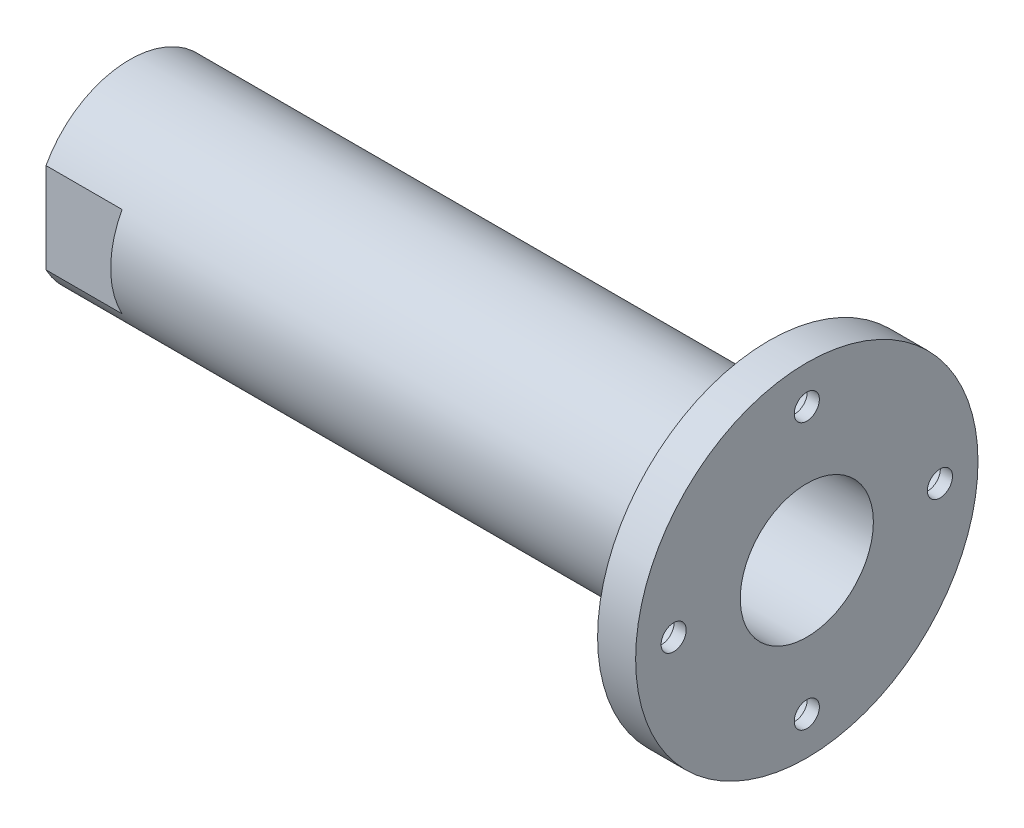
ISO-10303-21;
HEADER;
FILE_DESCRIPTION(('STEP AP214'),'2;1');
FILE_NAME('part.step','',(''),(''),'','','');
FILE_SCHEMA(('AUTOMOTIVE_DESIGN { 1 0 10303 214 1 1 1 1 }'));
ENDSEC;
DATA;
#1=APPLICATION_CONTEXT('core data for automotive mechanical design processes');
#2=APPLICATION_PROTOCOL_DEFINITION('international standard','automotive_design',2000,#1);
#3=PRODUCT_CONTEXT('',#1,'mechanical');
#4=PRODUCT('Part','Part','',(#3));
#5=PRODUCT_RELATED_PRODUCT_CATEGORY('part','',(#4));
#6=PRODUCT_DEFINITION_FORMATION('','',#4);
#7=PRODUCT_DEFINITION_CONTEXT('part definition',#1,'design');
#8=PRODUCT_DEFINITION('design','',#6,#7);
#9=PRODUCT_DEFINITION_SHAPE('','',#8);
#10=(LENGTH_UNIT() NAMED_UNIT(*) SI_UNIT(.MILLI.,.METRE.));
#11=(NAMED_UNIT(*) PLANE_ANGLE_UNIT() SI_UNIT($,.RADIAN.));
#12=(NAMED_UNIT(*) SI_UNIT($,.STERADIAN.) SOLID_ANGLE_UNIT());
#13=UNCERTAINTY_MEASURE_WITH_UNIT(LENGTH_MEASURE(1.E-05),#10,'distance_accuracy_value','');
#14=(GEOMETRIC_REPRESENTATION_CONTEXT(3) GLOBAL_UNCERTAINTY_ASSIGNED_CONTEXT((#13)) GLOBAL_UNIT_ASSIGNED_CONTEXT((#10,
#11,#12)) REPRESENTATION_CONTEXT('',''));
#15=CARTESIAN_POINT('',(0.,0.,0.));
#16=DIRECTION('',(0.,0.,1.));
#17=DIRECTION('',(1.,0.,0.));
#18=AXIS2_PLACEMENT_3D('',#15,#16,#17);
#19=CARTESIAN_POINT('',(0.,0.,0.));
#20=DIRECTION('',(-1.,0.,0.));
#21=DIRECTION('',(0.,0.,1.));
#22=AXIS2_PLACEMENT_3D('',#19,#20,#21);
#23=CYLINDRICAL_SURFACE('',#22,11.75);
#24=CARTESIAN_POINT('',(0.,0.,0.));
#25=DIRECTION('',(-1.,0.,0.));
#26=DIRECTION('',(0.,0.,1.));
#27=AXIS2_PLACEMENT_3D('',#24,#25,#26);
#28=CIRCLE('',#27,11.75);
#29=CARTESIAN_POINT('',(0.,0.,11.75));
#30=VERTEX_POINT('',#29);
#31=EDGE_CURVE('E160',#30,#30,#28,.T.);
#32=ORIENTED_EDGE('',*,*,#31,.T.);
#33=EDGE_LOOP('',(#32));
#34=FACE_BOUND('',#33,.T.);
#35=CARTESIAN_POINT('',(58.,0.,0.));
#36=DIRECTION('',(1.,0.,0.));
#37=DIRECTION('',(0.,0.,-1.));
#38=AXIS2_PLACEMENT_3D('',#35,#36,#37);
#39=CIRCLE('',#38,11.75);
#40=CARTESIAN_POINT('',(58.,0.,-11.75));
#41=VERTEX_POINT('',#40);
#42=EDGE_CURVE('E42',#41,#41,#39,.F.);
#43=ORIENTED_EDGE('',*,*,#42,.F.);
#44=EDGE_LOOP('',(#43));
#45=FACE_BOUND('',#44,.T.);
#46=ADVANCED_FACE('F38',(#34,#45),#23,.F.);
#47=CARTESIAN_POINT('',(-8.83733601826519,0.,0.));
#48=DIRECTION('',(-1.,0.,0.));
#49=DIRECTION('',(0.,0.,1.));
#50=AXIS2_PLACEMENT_3D('',#47,#48,#49);
#51=CYLINDRICAL_SURFACE('',#50,25.);
#52=DIRECTION('',(-1.,0.,0.));
#53=VECTOR('',#52,1.);
#54=CARTESIAN_POINT('',(-8.83733601826519,11.8743420870379,22.));
#55=LINE('',#54,#53);
#56=CARTESIAN_POINT('',(20.,11.8743420870379,22.));
#57=VERTEX_POINT('',#56);
#58=CARTESIAN_POINT('',(0.,11.8743420870379,22.));
#59=VERTEX_POINT('',#58);
#60=EDGE_CURVE('E47',#57,#59,#55,.T.);
#61=ORIENTED_EDGE('',*,*,#60,.F.);
#62=CARTESIAN_POINT('',(20.,0.,0.));
#63=DIRECTION('',(-1.,0.,0.));
#64=DIRECTION('',(0.,0.,1.));
#65=AXIS2_PLACEMENT_3D('',#62,#63,#64);
#66=CIRCLE('',#65,25.);
#67=CARTESIAN_POINT('',(20.,-11.8743420870379,22.));
#68=VERTEX_POINT('',#67);
#69=EDGE_CURVE('E107',#68,#57,#66,.T.);
#70=ORIENTED_EDGE('',*,*,#69,.F.);
#71=DIRECTION('',(-1.,0.,0.));
#72=VECTOR('',#71,1.);
#73=CARTESIAN_POINT('',(-8.83733601826519,-11.8743420870379,22.));
#74=LINE('',#73,#72);
#75=CARTESIAN_POINT('',(0.,-11.8743420870379,22.));
#76=VERTEX_POINT('',#75);
#77=EDGE_CURVE('E86',#76,#68,#74,.F.);
#78=ORIENTED_EDGE('',*,*,#77,.F.);
#79=CARTESIAN_POINT('',(0.,0.,0.));
#80=DIRECTION('',(-1.,0.,0.));
#81=DIRECTION('',(0.,0.,1.));
#82=AXIS2_PLACEMENT_3D('',#79,#80,#81);
#83=CIRCLE('',#82,25.);
#84=CARTESIAN_POINT('',(0.,-11.8743420870379,-22.));
#85=VERTEX_POINT('',#84);
#86=EDGE_CURVE('E92',#85,#76,#83,.T.);
#87=ORIENTED_EDGE('',*,*,#86,.F.);
#88=DIRECTION('',(-1.,0.,0.));
#89=VECTOR('',#88,1.);
#90=CARTESIAN_POINT('',(-8.83733601826519,-11.8743420870379,-22.));
#91=LINE('',#90,#89);
#92=CARTESIAN_POINT('',(20.,-11.8743420870379,-22.));
#93=VERTEX_POINT('',#92);
#94=EDGE_CURVE('E79',#93,#85,#91,.T.);
#95=ORIENTED_EDGE('',*,*,#94,.F.);
#96=CARTESIAN_POINT('',(20.,11.8743420870379,-22.));
#97=VERTEX_POINT('',#96);
#98=EDGE_CURVE('E87',#97,#93,#66,.T.);
#99=ORIENTED_EDGE('',*,*,#98,.F.);
#100=DIRECTION('',(-1.,0.,0.));
#101=VECTOR('',#100,1.);
#102=CARTESIAN_POINT('',(-8.83733601826519,11.8743420870379,-22.));
#103=LINE('',#102,#101);
#104=CARTESIAN_POINT('',(0.,11.8743420870379,-22.));
#105=VERTEX_POINT('',#104);
#106=EDGE_CURVE('E102',#105,#97,#103,.F.);
#107=ORIENTED_EDGE('',*,*,#106,.F.);
#108=EDGE_CURVE('E94',#59,#105,#83,.T.);
#109=ORIENTED_EDGE('',*,*,#108,.F.);
#110=EDGE_LOOP('',(#61,#70,#78,#87,#95,#99,#107,#109));
#111=FACE_BOUND('',#110,.T.);
#112=CARTESIAN_POINT('',(168.,0.,0.));
#113=DIRECTION('',(1.,0.,0.));
#114=DIRECTION('',(0.,0.,-1.));
#115=AXIS2_PLACEMENT_3D('',#112,#113,#114);
#116=CIRCLE('',#115,25.);
#117=CARTESIAN_POINT('',(168.,0.,-25.));
#118=VERTEX_POINT('',#117);
#119=EDGE_CURVE('E12',#118,#118,#116,.T.);
#120=ORIENTED_EDGE('',*,*,#119,.F.);
#121=EDGE_LOOP('',(#120));
#122=FACE_BOUND('',#121,.T.);
#123=ADVANCED_FACE('F98',(#111,#122),#51,.T.);
#124=CARTESIAN_POINT('',(0.,0.,0.));
#125=DIRECTION('',(1.,0.,0.));
#126=DIRECTION('',(0.,0.,-1.));
#127=AXIS2_PLACEMENT_3D('',#124,#125,#126);
#128=PLANE('',#127);
#129=ORIENTED_EDGE('',*,*,#31,.F.);
#130=EDGE_LOOP('',(#129));
#131=FACE_BOUND('',#130,.T.);
#132=DIRECTION('',(0.,1.,0.));
#133=VECTOR('',#132,1.);
#134=CARTESIAN_POINT('',(0.,-30.,22.));
#135=LINE('',#134,#133);
#136=EDGE_CURVE('E54',#76,#59,#135,.T.);
#137=ORIENTED_EDGE('',*,*,#136,.T.);
#138=ORIENTED_EDGE('',*,*,#108,.T.);
#139=DIRECTION('',(0.,-1.,0.));
#140=VECTOR('',#139,1.);
#141=CARTESIAN_POINT('',(0.,-30.,-22.));
#142=LINE('',#141,#140);
#143=EDGE_CURVE('E62',#105,#85,#142,.T.);
#144=ORIENTED_EDGE('',*,*,#143,.T.);
#145=ORIENTED_EDGE('',*,*,#86,.T.);
#146=EDGE_LOOP('',(#137,#138,#144,#145));
#147=FACE_BOUND('',#146,.T.);
#148=ADVANCED_FACE('F40',(#131,#147),#128,.F.);
#149=CARTESIAN_POINT('',(178.,25.,0.));
#150=DIRECTION('',(-1.,0.,0.));
#151=DIRECTION('',(0.,0.,1.));
#152=AXIS2_PLACEMENT_3D('',#149,#150,#151);
#153=PLANE('',#152);
#154=CARTESIAN_POINT('',(178.,0.,0.));
#155=DIRECTION('',(1.,0.,0.));
#156=DIRECTION('',(0.,0.,-1.));
#157=AXIS2_PLACEMENT_3D('',#154,#155,#156);
#158=CIRCLE('',#157,17.5);
#159=CARTESIAN_POINT('',(178.,0.,-17.5));
#160=VERTEX_POINT('',#159);
#161=EDGE_CURVE('E179',#160,#160,#158,.T.);
#162=ORIENTED_EDGE('',*,*,#161,.F.);
#163=EDGE_LOOP('',(#162));
#164=FACE_BOUND('',#163,.T.);
#165=CARTESIAN_POINT('',(178.,-35.,0.));
#166=DIRECTION('',(-1.,0.,0.));
#167=DIRECTION('',(0.,0.,-1.));
#168=AXIS2_PLACEMENT_3D('',#165,#166,#167);
#169=CIRCLE('',#168,3.3);
#170=CARTESIAN_POINT('',(178.,-35.,-3.3));
#171=VERTEX_POINT('',#170);
#172=EDGE_CURVE('E183',#171,#171,#169,.T.);
#173=ORIENTED_EDGE('',*,*,#172,.T.);
#174=EDGE_LOOP('',(#173));
#175=FACE_BOUND('',#174,.T.);
#176=CARTESIAN_POINT('',(178.,3.66605540578529E-13,-35.));
#177=DIRECTION('',(-1.,0.,0.));
#178=DIRECTION('',(0.,1.,0.));
#179=AXIS2_PLACEMENT_3D('',#176,#177,#178);
#180=CIRCLE('',#179,3.3);
#181=CARTESIAN_POINT('',(178.,3.30000000000036,-35.));
#182=VERTEX_POINT('',#181);
#183=EDGE_CURVE('E187',#182,#182,#180,.T.);
#184=ORIENTED_EDGE('',*,*,#183,.T.);
#185=EDGE_LOOP('',(#184));
#186=FACE_BOUND('',#185,.T.);
#187=CARTESIAN_POINT('',(178.,-1.2220184685951E-13,35.));
#188=DIRECTION('',(-1.,0.,0.));
#189=DIRECTION('',(0.,-1.,0.));
#190=AXIS2_PLACEMENT_3D('',#187,#188,#189);
#191=CIRCLE('',#190,3.3);
#192=CARTESIAN_POINT('',(178.,-3.30000000000012,35.));
#193=VERTEX_POINT('',#192);
#194=EDGE_CURVE('E191',#193,#193,#191,.T.);
#195=ORIENTED_EDGE('',*,*,#194,.T.);
#196=EDGE_LOOP('',(#195));
#197=FACE_BOUND('',#196,.T.);
#198=CARTESIAN_POINT('',(178.,35.,0.));
#199=DIRECTION('',(-1.,0.,0.));
#200=DIRECTION('',(0.,0.,1.));
#201=AXIS2_PLACEMENT_3D('',#198,#199,#200);
#202=CIRCLE('',#201,3.3);
#203=CARTESIAN_POINT('',(178.,35.,3.3));
#204=VERTEX_POINT('',#203);
#205=EDGE_CURVE('E158',#204,#204,#202,.T.);
#206=ORIENTED_EDGE('',*,*,#205,.T.);
#207=EDGE_LOOP('',(#206));
#208=FACE_BOUND('',#207,.T.);
#209=CARTESIAN_POINT('',(178.,0.,0.));
#210=DIRECTION('',(1.,0.,0.));
#211=DIRECTION('',(0.,0.,-1.));
#212=AXIS2_PLACEMENT_3D('',#209,#210,#211);
#213=CIRCLE('',#212,45.);
#214=CARTESIAN_POINT('',(178.,0.,-45.));
#215=VERTEX_POINT('',#214);
#216=EDGE_CURVE('E156',#215,#215,#213,.T.);
#217=ORIENTED_EDGE('',*,*,#216,.T.);
#218=EDGE_LOOP('',(#217));
#219=FACE_BOUND('',#218,.T.);
#220=ADVANCED_FACE('F124',(#164,#175,#186,#197,#208,#219),#153,.F.);
#221=CARTESIAN_POINT('',(20.,-30.,-22.));
#222=DIRECTION('',(0.,0.,-1.));
#223=DIRECTION('',(-1.,0.,0.));
#224=AXIS2_PLACEMENT_3D('',#221,#222,#223);
#225=PLANE('',#224);
#226=ORIENTED_EDGE('',*,*,#94,.T.);
#227=ORIENTED_EDGE('',*,*,#143,.F.);
#228=ORIENTED_EDGE('',*,*,#106,.T.);
#229=DIRECTION('',(0.,-1.,0.));
#230=VECTOR('',#229,1.);
#231=CARTESIAN_POINT('',(20.,-30.,-22.));
#232=LINE('',#231,#230);
#233=EDGE_CURVE('E82',#97,#93,#232,.T.);
#234=ORIENTED_EDGE('',*,*,#233,.T.);
#235=EDGE_LOOP('',(#226,#227,#228,#234));
#236=FACE_BOUND('',#235,.T.);
#237=ADVANCED_FACE('F80',(#236),#225,.T.);
#238=CARTESIAN_POINT('',(20.,0.,0.));
#239=DIRECTION('',(-1.,0.,0.));
#240=DIRECTION('',(0.,0.,1.));
#241=AXIS2_PLACEMENT_3D('',#238,#239,#240);
#242=PLANE('',#241);
#243=ORIENTED_EDGE('',*,*,#98,.T.);
#244=ORIENTED_EDGE('',*,*,#233,.F.);
#245=EDGE_LOOP('',(#243,#244));
#246=FACE_BOUND('',#245,.T.);
#247=ADVANCED_FACE('F117',(#246),#242,.T.);
#248=ORIENTED_EDGE('',*,*,#69,.T.);
#249=DIRECTION('',(0.,1.,0.));
#250=VECTOR('',#249,1.);
#251=CARTESIAN_POINT('',(20.,-30.,22.));
#252=LINE('',#251,#250);
#253=EDGE_CURVE('E95',#68,#57,#252,.T.);
#254=ORIENTED_EDGE('',*,*,#253,.F.);
#255=EDGE_LOOP('',(#248,#254));
#256=FACE_BOUND('',#255,.T.);
#257=ADVANCED_FACE('F113',(#256),#242,.T.);
#258=CARTESIAN_POINT('',(20.,-30.,22.));
#259=DIRECTION('',(0.,0.,1.));
#260=DIRECTION('',(1.,0.,0.));
#261=AXIS2_PLACEMENT_3D('',#258,#259,#260);
#262=PLANE('',#261);
#263=ORIENTED_EDGE('',*,*,#60,.T.);
#264=ORIENTED_EDGE('',*,*,#136,.F.);
#265=ORIENTED_EDGE('',*,*,#77,.T.);
#266=ORIENTED_EDGE('',*,*,#253,.T.);
#267=EDGE_LOOP('',(#263,#264,#265,#266));
#268=FACE_BOUND('',#267,.T.);
#269=ADVANCED_FACE('F114',(#268),#262,.T.);
#270=CARTESIAN_POINT('',(168.,0.,0.));
#271=DIRECTION('',(1.,0.,0.));
#272=DIRECTION('',(0.,0.,-1.));
#273=AXIS2_PLACEMENT_3D('',#270,#271,#272);
#274=CYLINDRICAL_SURFACE('',#273,45.);
#275=CARTESIAN_POINT('',(168.,0.,0.));
#276=DIRECTION('',(1.,0.,0.));
#277=DIRECTION('',(0.,0.,-1.));
#278=AXIS2_PLACEMENT_3D('',#275,#276,#277);
#279=CIRCLE('',#278,45.);
#280=CARTESIAN_POINT('',(168.,0.,-45.));
#281=VERTEX_POINT('',#280);
#282=EDGE_CURVE('E153',#281,#281,#279,.T.);
#283=ORIENTED_EDGE('',*,*,#282,.T.);
#284=EDGE_LOOP('',(#283));
#285=FACE_BOUND('',#284,.T.);
#286=ORIENTED_EDGE('',*,*,#216,.F.);
#287=EDGE_LOOP('',(#286));
#288=FACE_BOUND('',#287,.T.);
#289=ADVANCED_FACE('F137',(#285,#288),#274,.T.);
#290=CARTESIAN_POINT('',(168.,0.,0.));
#291=DIRECTION('',(1.,0.,0.));
#292=DIRECTION('',(0.,0.,-1.));
#293=AXIS2_PLACEMENT_3D('',#290,#291,#292);
#294=PLANE('',#293);
#295=CARTESIAN_POINT('',(168.,-35.,0.));
#296=DIRECTION('',(-1.,0.,0.));
#297=DIRECTION('',(0.,0.,-1.));
#298=AXIS2_PLACEMENT_3D('',#295,#296,#297);
#299=CIRCLE('',#298,5.5);
#300=CARTESIAN_POINT('',(168.,-35.,-5.5));
#301=VERTEX_POINT('',#300);
#302=EDGE_CURVE('E223',#301,#301,#299,.T.);
#303=ORIENTED_EDGE('',*,*,#302,.F.);
#304=EDGE_LOOP('',(#303));
#305=FACE_BOUND('',#304,.T.);
#306=CARTESIAN_POINT('',(168.,3.66605540578529E-13,-35.));
#307=DIRECTION('',(-1.,0.,0.));
#308=DIRECTION('',(0.,1.,0.));
#309=AXIS2_PLACEMENT_3D('',#306,#307,#308);
#310=CIRCLE('',#309,5.5);
#311=CARTESIAN_POINT('',(168.,5.50000000000037,-35.));
#312=VERTEX_POINT('',#311);
#313=EDGE_CURVE('E228',#312,#312,#310,.T.);
#314=ORIENTED_EDGE('',*,*,#313,.F.);
#315=EDGE_LOOP('',(#314));
#316=FACE_BOUND('',#315,.T.);
#317=CARTESIAN_POINT('',(168.,-1.2220184685951E-13,35.));
#318=DIRECTION('',(-1.,0.,0.));
#319=DIRECTION('',(0.,-1.,0.));
#320=AXIS2_PLACEMENT_3D('',#317,#318,#319);
#321=CIRCLE('',#320,5.5);
#322=CARTESIAN_POINT('',(168.,-5.50000000000012,35.));
#323=VERTEX_POINT('',#322);
#324=EDGE_CURVE('E216',#323,#323,#321,.T.);
#325=ORIENTED_EDGE('',*,*,#324,.F.);
#326=EDGE_LOOP('',(#325));
#327=FACE_BOUND('',#326,.T.);
#328=CARTESIAN_POINT('',(168.,35.,0.));
#329=DIRECTION('',(-1.,0.,0.));
#330=DIRECTION('',(0.,0.,1.));
#331=AXIS2_PLACEMENT_3D('',#328,#329,#330);
#332=CIRCLE('',#331,5.5);
#333=CARTESIAN_POINT('',(168.,35.,5.5));
#334=VERTEX_POINT('',#333);
#335=EDGE_CURVE('E204',#334,#334,#332,.T.);
#336=ORIENTED_EDGE('',*,*,#335,.F.);
#337=EDGE_LOOP('',(#336));
#338=FACE_BOUND('',#337,.T.);
#339=ORIENTED_EDGE('',*,*,#119,.T.);
#340=EDGE_LOOP('',(#339));
#341=FACE_BOUND('',#340,.T.);
#342=ORIENTED_EDGE('',*,*,#282,.F.);
#343=EDGE_LOOP('',(#342));
#344=FACE_BOUND('',#343,.T.);
#345=ADVANCED_FACE('F143',(#305,#316,#327,#338,#341,#344),#294,.F.);
#346=CARTESIAN_POINT('',(168.,35.,0.));
#347=DIRECTION('',(-1.,0.,0.));
#348=DIRECTION('',(0.,0.,1.));
#349=AXIS2_PLACEMENT_3D('',#346,#347,#348);
#350=CYLINDRICAL_SURFACE('',#349,3.3);
#351=ORIENTED_EDGE('',*,*,#205,.F.);
#352=EDGE_LOOP('',(#351));
#353=FACE_BOUND('',#352,.T.);
#354=CARTESIAN_POINT('',(174.8,35.,0.));
#355=DIRECTION('',(-1.,0.,0.));
#356=DIRECTION('',(0.,0.,1.));
#357=AXIS2_PLACEMENT_3D('',#354,#355,#356);
#358=CIRCLE('',#357,3.30000000000001);
#359=CARTESIAN_POINT('',(174.8,35.,3.30000000000001));
#360=VERTEX_POINT('',#359);
#361=EDGE_CURVE('E163',#360,#360,#358,.T.);
#362=ORIENTED_EDGE('',*,*,#361,.T.);
#363=EDGE_LOOP('',(#362));
#364=FACE_BOUND('',#363,.T.);
#365=ADVANCED_FACE('F148',(#353,#364),#350,.F.);
#366=CARTESIAN_POINT('',(174.8,38.3,0.));
#367=DIRECTION('',(1.,0.,0.));
#368=DIRECTION('',(0.,0.,-1.));
#369=AXIS2_PLACEMENT_3D('',#366,#367,#368);
#370=PLANE('',#369);
#371=ORIENTED_EDGE('',*,*,#361,.F.);
#372=EDGE_LOOP('',(#371));
#373=FACE_BOUND('',#372,.T.);
#374=CARTESIAN_POINT('',(174.8,35.,0.));
#375=DIRECTION('',(-1.,0.,0.));
#376=DIRECTION('',(0.,0.,1.));
#377=AXIS2_PLACEMENT_3D('',#374,#375,#376);
#378=CIRCLE('',#377,5.5);
#379=CARTESIAN_POINT('',(174.8,35.,5.5));
#380=VERTEX_POINT('',#379);
#381=EDGE_CURVE('E201',#380,#380,#378,.T.);
#382=ORIENTED_EDGE('',*,*,#381,.T.);
#383=EDGE_LOOP('',(#382));
#384=FACE_BOUND('',#383,.T.);
#385=ADVANCED_FACE('F196',(#373,#384),#370,.F.);
#386=CARTESIAN_POINT('',(168.,35.,0.));
#387=DIRECTION('',(-1.,0.,0.));
#388=DIRECTION('',(0.,0.,1.));
#389=AXIS2_PLACEMENT_3D('',#386,#387,#388);
#390=CYLINDRICAL_SURFACE('',#389,5.5);
#391=ORIENTED_EDGE('',*,*,#381,.F.);
#392=EDGE_LOOP('',(#391));
#393=FACE_BOUND('',#392,.T.);
#394=ORIENTED_EDGE('',*,*,#335,.T.);
#395=EDGE_LOOP('',(#394));
#396=FACE_BOUND('',#395,.T.);
#397=ADVANCED_FACE('F292',(#393,#396),#390,.F.);
#398=CARTESIAN_POINT('',(168.,-1.2220184685951E-13,35.));
#399=DIRECTION('',(-1.,0.,0.));
#400=DIRECTION('',(0.,-1.,0.));
#401=AXIS2_PLACEMENT_3D('',#398,#399,#400);
#402=CYLINDRICAL_SURFACE('',#401,3.3);
#403=ORIENTED_EDGE('',*,*,#194,.F.);
#404=EDGE_LOOP('',(#403));
#405=FACE_BOUND('',#404,.T.);
#406=CARTESIAN_POINT('',(174.8,-1.2220184685951E-13,35.));
#407=DIRECTION('',(-1.,0.,0.));
#408=DIRECTION('',(0.,-1.,0.));
#409=AXIS2_PLACEMENT_3D('',#406,#407,#408);
#410=CIRCLE('',#409,3.30000000000001);
#411=CARTESIAN_POINT('',(174.8,-3.30000000000013,35.));
#412=VERTEX_POINT('',#411);
#413=EDGE_CURVE('E209',#412,#412,#410,.T.);
#414=ORIENTED_EDGE('',*,*,#413,.T.);
#415=EDGE_LOOP('',(#414));
#416=FACE_BOUND('',#415,.T.);
#417=ADVANCED_FACE('F288',(#405,#416),#402,.F.);
#418=CARTESIAN_POINT('',(174.8,-1.33723735277692E-13,38.3));
#419=DIRECTION('',(1.,0.,0.));
#420=DIRECTION('',(0.,1.,0.));
#421=AXIS2_PLACEMENT_3D('',#418,#419,#420);
#422=PLANE('',#421);
#423=ORIENTED_EDGE('',*,*,#413,.F.);
#424=EDGE_LOOP('',(#423));
#425=FACE_BOUND('',#424,.T.);
#426=CARTESIAN_POINT('',(174.8,-1.2220184685951E-13,35.));
#427=DIRECTION('',(-1.,0.,0.));
#428=DIRECTION('',(0.,-1.,0.));
#429=AXIS2_PLACEMENT_3D('',#426,#427,#428);
#430=CIRCLE('',#429,5.5);
#431=CARTESIAN_POINT('',(174.8,-5.50000000000012,35.));
#432=VERTEX_POINT('',#431);
#433=EDGE_CURVE('E212',#432,#432,#430,.T.);
#434=ORIENTED_EDGE('',*,*,#433,.T.);
#435=EDGE_LOOP('',(#434));
#436=FACE_BOUND('',#435,.T.);
#437=ADVANCED_FACE('F284',(#425,#436),#422,.F.);
#438=CARTESIAN_POINT('',(168.,-1.2220184685951E-13,35.));
#439=DIRECTION('',(-1.,0.,0.));
#440=DIRECTION('',(0.,-1.,0.));
#441=AXIS2_PLACEMENT_3D('',#438,#439,#440);
#442=CYLINDRICAL_SURFACE('',#441,5.5);
#443=ORIENTED_EDGE('',*,*,#433,.F.);
#444=EDGE_LOOP('',(#443));
#445=FACE_BOUND('',#444,.T.);
#446=ORIENTED_EDGE('',*,*,#324,.T.);
#447=EDGE_LOOP('',(#446));
#448=FACE_BOUND('',#447,.T.);
#449=ADVANCED_FACE('F280',(#445,#448),#442,.F.);
#450=CARTESIAN_POINT('',(168.,3.66605540578529E-13,-35.));
#451=DIRECTION('',(-1.,0.,0.));
#452=DIRECTION('',(0.,1.,0.));
#453=AXIS2_PLACEMENT_3D('',#450,#451,#452);
#454=CYLINDRICAL_SURFACE('',#453,3.3);
#455=ORIENTED_EDGE('',*,*,#183,.F.);
#456=EDGE_LOOP('',(#455));
#457=FACE_BOUND('',#456,.T.);
#458=CARTESIAN_POINT('',(174.8,3.66605540578529E-13,-35.));
#459=DIRECTION('',(-1.,0.,0.));
#460=DIRECTION('',(0.,1.,0.));
#461=AXIS2_PLACEMENT_3D('',#458,#459,#460);
#462=CIRCLE('',#461,3.30000000000001);
#463=CARTESIAN_POINT('',(174.8,3.30000000000038,-35.));
#464=VERTEX_POINT('',#463);
#465=EDGE_CURVE('E220',#464,#464,#462,.T.);
#466=ORIENTED_EDGE('',*,*,#465,.T.);
#467=EDGE_LOOP('',(#466));
#468=FACE_BOUND('',#467,.T.);
#469=ADVANCED_FACE('F276',(#457,#468),#454,.F.);
#470=CARTESIAN_POINT('',(174.8,4.01171205833076E-13,-38.3));
#471=DIRECTION('',(1.,0.,0.));
#472=DIRECTION('',(0.,-1.,0.));
#473=AXIS2_PLACEMENT_3D('',#470,#471,#472);
#474=PLANE('',#473);
#475=ORIENTED_EDGE('',*,*,#465,.F.);
#476=EDGE_LOOP('',(#475));
#477=FACE_BOUND('',#476,.T.);
#478=CARTESIAN_POINT('',(174.8,3.66605540578529E-13,-35.));
#479=DIRECTION('',(-1.,0.,0.));
#480=DIRECTION('',(0.,1.,0.));
#481=AXIS2_PLACEMENT_3D('',#478,#479,#480);
#482=CIRCLE('',#481,5.5);
#483=CARTESIAN_POINT('',(174.8,5.50000000000037,-35.));
#484=VERTEX_POINT('',#483);
#485=EDGE_CURVE('E224',#484,#484,#482,.T.);
#486=ORIENTED_EDGE('',*,*,#485,.T.);
#487=EDGE_LOOP('',(#486));
#488=FACE_BOUND('',#487,.T.);
#489=ADVANCED_FACE('F272',(#477,#488),#474,.F.);
#490=CARTESIAN_POINT('',(168.,3.66605540578529E-13,-35.));
#491=DIRECTION('',(-1.,0.,0.));
#492=DIRECTION('',(0.,1.,0.));
#493=AXIS2_PLACEMENT_3D('',#490,#491,#492);
#494=CYLINDRICAL_SURFACE('',#493,5.5);
#495=ORIENTED_EDGE('',*,*,#485,.F.);
#496=EDGE_LOOP('',(#495));
#497=FACE_BOUND('',#496,.T.);
#498=ORIENTED_EDGE('',*,*,#313,.T.);
#499=EDGE_LOOP('',(#498));
#500=FACE_BOUND('',#499,.T.);
#501=ADVANCED_FACE('F268',(#497,#500),#494,.F.);
#502=CARTESIAN_POINT('',(168.,-35.,0.));
#503=DIRECTION('',(-1.,0.,0.));
#504=DIRECTION('',(0.,0.,-1.));
#505=AXIS2_PLACEMENT_3D('',#502,#503,#504);
#506=CYLINDRICAL_SURFACE('',#505,3.3);
#507=ORIENTED_EDGE('',*,*,#172,.F.);
#508=EDGE_LOOP('',(#507));
#509=FACE_BOUND('',#508,.T.);
#510=CARTESIAN_POINT('',(174.8,-35.,0.));
#511=DIRECTION('',(-1.,0.,0.));
#512=DIRECTION('',(0.,0.,-1.));
#513=AXIS2_PLACEMENT_3D('',#510,#511,#512);
#514=CIRCLE('',#513,3.30000000000001);
#515=CARTESIAN_POINT('',(174.8,-35.,-3.30000000000001));
#516=VERTEX_POINT('',#515);
#517=EDGE_CURVE('E219',#516,#516,#514,.T.);
#518=ORIENTED_EDGE('',*,*,#517,.T.);
#519=EDGE_LOOP('',(#518));
#520=FACE_BOUND('',#519,.T.);
#521=ADVANCED_FACE('F264',(#509,#520),#506,.F.);
#522=CARTESIAN_POINT('',(174.8,-38.3,0.));
#523=DIRECTION('',(1.,0.,0.));
#524=DIRECTION('',(0.,0.,1.));
#525=AXIS2_PLACEMENT_3D('',#522,#523,#524);
#526=PLANE('',#525);
#527=ORIENTED_EDGE('',*,*,#517,.F.);
#528=EDGE_LOOP('',(#527));
#529=FACE_BOUND('',#528,.T.);
#530=CARTESIAN_POINT('',(174.8,-35.,0.));
#531=DIRECTION('',(-1.,0.,0.));
#532=DIRECTION('',(0.,0.,-1.));
#533=AXIS2_PLACEMENT_3D('',#530,#531,#532);
#534=CIRCLE('',#533,5.5);
#535=CARTESIAN_POINT('',(174.8,-35.,-5.5));
#536=VERTEX_POINT('',#535);
#537=EDGE_CURVE('E233',#536,#536,#534,.T.);
#538=ORIENTED_EDGE('',*,*,#537,.T.);
#539=EDGE_LOOP('',(#538));
#540=FACE_BOUND('',#539,.T.);
#541=ADVANCED_FACE('F258',(#529,#540),#526,.F.);
#542=CARTESIAN_POINT('',(168.,-35.,0.));
#543=DIRECTION('',(-1.,0.,0.));
#544=DIRECTION('',(0.,0.,-1.));
#545=AXIS2_PLACEMENT_3D('',#542,#543,#544);
#546=CYLINDRICAL_SURFACE('',#545,5.5);
#547=ORIENTED_EDGE('',*,*,#537,.F.);
#548=EDGE_LOOP('',(#547));
#549=FACE_BOUND('',#548,.T.);
#550=ORIENTED_EDGE('',*,*,#302,.T.);
#551=EDGE_LOOP('',(#550));
#552=FACE_BOUND('',#551,.T.);
#553=ADVANCED_FACE('F250',(#549,#552),#546,.F.);
#554=CARTESIAN_POINT('',(58.,0.,0.));
#555=DIRECTION('',(1.,0.,0.));
#556=DIRECTION('',(0.,0.,-1.));
#557=AXIS2_PLACEMENT_3D('',#554,#555,#556);
#558=PLANE('',#557);
#559=CARTESIAN_POINT('',(58.,0.,0.));
#560=DIRECTION('',(1.,0.,0.));
#561=DIRECTION('',(0.,0.,-1.));
#562=AXIS2_PLACEMENT_3D('',#559,#560,#561);
#563=CIRCLE('',#562,17.5);
#564=CARTESIAN_POINT('',(58.,0.,-17.5));
#565=VERTEX_POINT('',#564);
#566=EDGE_CURVE('E240',#565,#565,#563,.T.);
#567=ORIENTED_EDGE('',*,*,#566,.T.);
#568=EDGE_LOOP('',(#567));
#569=FACE_BOUND('',#568,.T.);
#570=ORIENTED_EDGE('',*,*,#42,.T.);
#571=EDGE_LOOP('',(#570));
#572=FACE_BOUND('',#571,.T.);
#573=ADVANCED_FACE('F247',(#569,#572),#558,.T.);
#574=CARTESIAN_POINT('',(58.,0.,0.));
#575=DIRECTION('',(1.,0.,0.));
#576=DIRECTION('',(0.,0.,-1.));
#577=AXIS2_PLACEMENT_3D('',#574,#575,#576);
#578=CYLINDRICAL_SURFACE('',#577,17.5);
#579=ORIENTED_EDGE('',*,*,#566,.F.);
#580=EDGE_LOOP('',(#579));
#581=FACE_BOUND('',#580,.T.);
#582=ORIENTED_EDGE('',*,*,#161,.T.);
#583=EDGE_LOOP('',(#582));
#584=FACE_BOUND('',#583,.T.);
#585=ADVANCED_FACE('F249',(#581,#584),#578,.F.);
#586=CLOSED_SHELL('',(#46,#123,#148,#220,#237,#247,#257,#269,#289,#345,#365,#385,#397,#417,#437,
#449,#469,#489,#501,#521,#541,#553,#573,#585));
#587=MANIFOLD_SOLID_BREP('B2',#586);
#588=ADVANCED_BREP_SHAPE_REPRESENTATION('',(#18,#587),#14);
#589=SHAPE_DEFINITION_REPRESENTATION(#9,#588);
ENDSEC;
END-ISO-10303-21;
